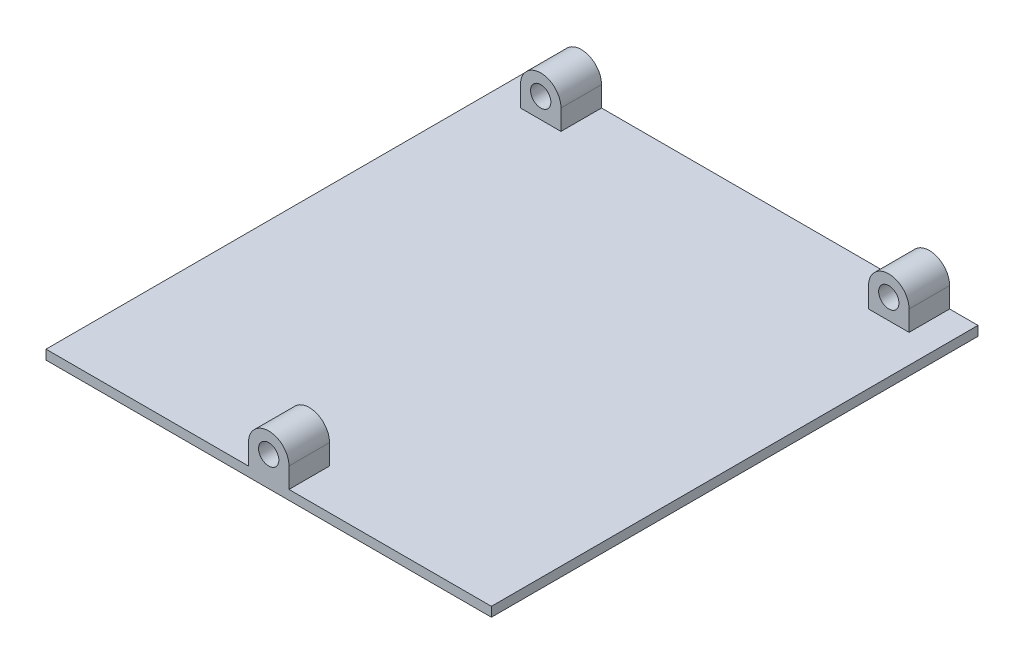
ISO-10303-21;
HEADER;
FILE_DESCRIPTION(('STEP AP214'),'2;1');
FILE_NAME('part.step','',(''),(''),'','','');
FILE_SCHEMA(('AUTOMOTIVE_DESIGN { 1 0 10303 214 1 1 1 1 }'));
ENDSEC;
DATA;
#1=APPLICATION_CONTEXT('core data for automotive mechanical design processes');
#2=APPLICATION_PROTOCOL_DEFINITION('international standard','automotive_design',2000,#1);
#3=PRODUCT_CONTEXT('',#1,'mechanical');
#4=PRODUCT('Part','Part','',(#3));
#5=PRODUCT_RELATED_PRODUCT_CATEGORY('part','',(#4));
#6=PRODUCT_DEFINITION_FORMATION('','',#4);
#7=PRODUCT_DEFINITION_CONTEXT('part definition',#1,'design');
#8=PRODUCT_DEFINITION('design','',#6,#7);
#9=PRODUCT_DEFINITION_SHAPE('','',#8);
#10=(LENGTH_UNIT() NAMED_UNIT(*) SI_UNIT(.MILLI.,.METRE.));
#11=(NAMED_UNIT(*) PLANE_ANGLE_UNIT() SI_UNIT($,.RADIAN.));
#12=(NAMED_UNIT(*) SI_UNIT($,.STERADIAN.) SOLID_ANGLE_UNIT());
#13=UNCERTAINTY_MEASURE_WITH_UNIT(LENGTH_MEASURE(1.E-05),#10,'distance_accuracy_value','');
#14=(GEOMETRIC_REPRESENTATION_CONTEXT(3) GLOBAL_UNCERTAINTY_ASSIGNED_CONTEXT((#13)) GLOBAL_UNIT_ASSIGNED_CONTEXT((#10,
#11,#12)) REPRESENTATION_CONTEXT('',''));
#15=CARTESIAN_POINT('',(0.,0.,0.));
#16=DIRECTION('',(0.,0.,1.));
#17=DIRECTION('',(1.,0.,0.));
#18=AXIS2_PLACEMENT_3D('',#15,#16,#17);
#19=CARTESIAN_POINT('',(0.,6.35,0.));
#20=DIRECTION('',(1.,0.,0.));
#21=DIRECTION('',(0.,0.,-1.));
#22=AXIS2_PLACEMENT_3D('',#19,#20,#21);
#23=PLANE('',#22);
#24=DIRECTION('',(0.,0.,1.));
#25=VECTOR('',#24,1.);
#26=CARTESIAN_POINT('',(0.,2.975,-152.4));
#27=LINE('',#26,#25);
#28=CARTESIAN_POINT('',(0.,2.975,-152.4));
#29=VERTEX_POINT('',#28);
#30=CARTESIAN_POINT('',(0.,2.975,0.));
#31=VERTEX_POINT('',#30);
#32=EDGE_CURVE('E252',#29,#31,#27,.T.);
#33=ORIENTED_EDGE('',*,*,#32,.F.);
#34=DIRECTION('',(0.,-1.,0.));
#35=VECTOR('',#34,1.);
#36=CARTESIAN_POINT('',(0.,6.35,-152.4));
#37=LINE('',#36,#35);
#38=CARTESIAN_POINT('',(0.,0.,-152.4));
#39=VERTEX_POINT('',#38);
#40=EDGE_CURVE('E282',#29,#39,#37,.T.);
#41=ORIENTED_EDGE('',*,*,#40,.T.);
#42=DIRECTION('',(0.,0.,1.));
#43=VECTOR('',#42,1.);
#44=CARTESIAN_POINT('',(0.,0.,0.));
#45=LINE('',#44,#43);
#46=CARTESIAN_POINT('',(0.,0.,0.));
#47=VERTEX_POINT('',#46);
#48=EDGE_CURVE('E269',#39,#47,#45,.T.);
#49=ORIENTED_EDGE('',*,*,#48,.T.);
#50=DIRECTION('',(0.,-1.,0.));
#51=VECTOR('',#50,1.);
#52=CARTESIAN_POINT('',(0.,6.35,0.));
#53=LINE('',#52,#51);
#54=EDGE_CURVE('E11',#31,#47,#53,.T.);
#55=ORIENTED_EDGE('',*,*,#54,.F.);
#56=EDGE_LOOP('',(#33,#41,#49,#55));
#57=FACE_BOUND('',#56,.T.);
#58=ADVANCED_FACE('F37',(#57),#23,.F.);
#59=CARTESIAN_POINT('',(0.,6.35,0.));
#60=DIRECTION('',(0.,0.,-1.));
#61=DIRECTION('',(-1.,0.,0.));
#62=AXIS2_PLACEMENT_3D('',#59,#60,#61);
#63=PLANE('',#62);
#64=DIRECTION('',(1.,0.,0.));
#65=VECTOR('',#64,1.);
#66=CARTESIAN_POINT('',(0.,2.975,0.));
#67=LINE('',#66,#65);
#68=CARTESIAN_POINT('',(63.4,2.975,0.));
#69=VERTEX_POINT('',#68);
#70=EDGE_CURVE('E261',#31,#69,#67,.T.);
#71=ORIENTED_EDGE('',*,*,#70,.F.);
#72=ORIENTED_EDGE('',*,*,#54,.T.);
#73=DIRECTION('',(1.,0.,0.));
#74=VECTOR('',#73,1.);
#75=CARTESIAN_POINT('',(0.,0.,0.));
#76=LINE('',#75,#74);
#77=CARTESIAN_POINT('',(139.5,0.,0.));
#78=VERTEX_POINT('',#77);
#79=EDGE_CURVE('E273',#47,#78,#76,.T.);
#80=ORIENTED_EDGE('',*,*,#79,.T.);
#81=DIRECTION('',(0.,-1.,0.));
#82=VECTOR('',#81,1.);
#83=CARTESIAN_POINT('',(139.5,6.35,0.));
#84=LINE('',#83,#82);
#85=CARTESIAN_POINT('',(139.5,2.975,0.));
#86=VERTEX_POINT('',#85);
#87=EDGE_CURVE('E44',#86,#78,#84,.T.);
#88=ORIENTED_EDGE('',*,*,#87,.F.);
#89=CARTESIAN_POINT('',(76.1,2.975,0.));
#90=VERTEX_POINT('',#89);
#91=EDGE_CURVE('E260',#90,#86,#67,.T.);
#92=ORIENTED_EDGE('',*,*,#91,.F.);
#93=DIRECTION('',(0.,1.,0.));
#94=VECTOR('',#93,1.);
#95=CARTESIAN_POINT('',(76.1,9.32500063341215,0.));
#96=LINE('',#95,#94);
#97=CARTESIAN_POINT('',(76.1,9.32500063341215,0.));
#98=VERTEX_POINT('',#97);
#99=EDGE_CURVE('E233',#90,#98,#96,.T.);
#100=ORIENTED_EDGE('',*,*,#99,.T.);
#101=CARTESIAN_POINT('',(69.75,9.32500031670607,0.));
#102=DIRECTION('',(0.,0.,1.));
#103=DIRECTION('',(1.,0.,0.));
#104=AXIS2_PLACEMENT_3D('',#101,#102,#103);
#105=CIRCLE('',#104,6.35);
#106=CARTESIAN_POINT('',(63.4,9.325,0.));
#107=VERTEX_POINT('',#106);
#108=EDGE_CURVE('E226',#98,#107,#105,.T.);
#109=ORIENTED_EDGE('',*,*,#108,.T.);
#110=DIRECTION('',(0.,-1.,0.));
#111=VECTOR('',#110,1.);
#112=CARTESIAN_POINT('',(63.4,9.325,0.));
#113=LINE('',#112,#111);
#114=EDGE_CURVE('E245',#107,#69,#113,.T.);
#115=ORIENTED_EDGE('',*,*,#114,.T.);
#116=EDGE_LOOP('',(#71,#72,#80,#88,#92,#100,#109,#115));
#117=FACE_BOUND('',#116,.T.);
#118=CARTESIAN_POINT('',(69.75,9.32500031670607,0.));
#119=DIRECTION('',(0.,0.,1.));
#120=DIRECTION('',(1.,0.,0.));
#121=AXIS2_PLACEMENT_3D('',#118,#119,#120);
#122=CIRCLE('',#121,3.17499999999998);
#123=CARTESIAN_POINT('',(72.925,9.32500031670607,0.));
#124=VERTEX_POINT('',#123);
#125=EDGE_CURVE('E215',#124,#124,#122,.T.);
#126=ORIENTED_EDGE('',*,*,#125,.F.);
#127=EDGE_LOOP('',(#126));
#128=FACE_BOUND('',#127,.T.);
#129=ADVANCED_FACE('F296',(#117,#128),#63,.F.);
#130=CARTESIAN_POINT('',(139.5,6.35,0.));
#131=DIRECTION('',(-1.,0.,0.));
#132=DIRECTION('',(0.,0.,1.));
#133=AXIS2_PLACEMENT_3D('',#130,#131,#132);
#134=PLANE('',#133);
#135=DIRECTION('',(0.,0.,-1.));
#136=VECTOR('',#135,1.);
#137=CARTESIAN_POINT('',(139.5,2.975,-152.4));
#138=LINE('',#137,#136);
#139=CARTESIAN_POINT('',(139.5,2.975,-152.4));
#140=VERTEX_POINT('',#139);
#141=EDGE_CURVE('E264',#86,#140,#138,.T.);
#142=ORIENTED_EDGE('',*,*,#141,.F.);
#143=ORIENTED_EDGE('',*,*,#87,.T.);
#144=DIRECTION('',(0.,0.,-1.));
#145=VECTOR('',#144,1.);
#146=CARTESIAN_POINT('',(139.5,0.,0.));
#147=LINE('',#146,#145);
#148=CARTESIAN_POINT('',(139.5,0.,-152.4));
#149=VERTEX_POINT('',#148);
#150=EDGE_CURVE('E276',#78,#149,#147,.T.);
#151=ORIENTED_EDGE('',*,*,#150,.T.);
#152=DIRECTION('',(0.,-1.,0.));
#153=VECTOR('',#152,1.);
#154=CARTESIAN_POINT('',(139.5,6.35,-152.4));
#155=LINE('',#154,#153);
#156=EDGE_CURVE('E284',#140,#149,#155,.T.);
#157=ORIENTED_EDGE('',*,*,#156,.F.);
#158=EDGE_LOOP('',(#142,#143,#151,#157));
#159=FACE_BOUND('',#158,.T.);
#160=ADVANCED_FACE('F288',(#159),#134,.F.);
#161=CARTESIAN_POINT('',(0.,6.35,-152.4));
#162=DIRECTION('',(0.,0.,1.));
#163=DIRECTION('',(1.,0.,0.));
#164=AXIS2_PLACEMENT_3D('',#161,#162,#163);
#165=PLANE('',#164);
#166=DIRECTION('',(-1.,0.,0.));
#167=VECTOR('',#166,1.);
#168=CARTESIAN_POINT('',(0.,2.975,-152.4));
#169=LINE('',#168,#167);
#170=CARTESIAN_POINT('',(130.61,2.975,-152.4));
#171=VERTEX_POINT('',#170);
#172=EDGE_CURVE('E267',#140,#171,#169,.T.);
#173=ORIENTED_EDGE('',*,*,#172,.F.);
#174=ORIENTED_EDGE('',*,*,#156,.T.);
#175=DIRECTION('',(-1.,0.,0.));
#176=VECTOR('',#175,1.);
#177=CARTESIAN_POINT('',(0.,0.,-152.4));
#178=LINE('',#177,#176);
#179=EDGE_CURVE('E279',#149,#39,#178,.T.);
#180=ORIENTED_EDGE('',*,*,#179,.T.);
#181=ORIENTED_EDGE('',*,*,#40,.F.);
#182=CARTESIAN_POINT('',(8.89,2.975,-152.4));
#183=VERTEX_POINT('',#182);
#184=EDGE_CURVE('E266',#183,#29,#169,.T.);
#185=ORIENTED_EDGE('',*,*,#184,.F.);
#186=DIRECTION('',(0.,1.,0.));
#187=VECTOR('',#186,1.);
#188=CARTESIAN_POINT('',(8.89,9.325,-152.4));
#189=LINE('',#188,#187);
#190=CARTESIAN_POINT('',(8.89,9.325,-152.4));
#191=VERTEX_POINT('',#190);
#192=EDGE_CURVE('E168',#183,#191,#189,.T.);
#193=ORIENTED_EDGE('',*,*,#192,.T.);
#194=CARTESIAN_POINT('',(15.24,9.325,-152.4));
#195=DIRECTION('',(0.,0.,-1.));
#196=DIRECTION('',(-1.,0.,0.));
#197=AXIS2_PLACEMENT_3D('',#194,#195,#196);
#198=CIRCLE('',#197,6.35);
#199=CARTESIAN_POINT('',(21.59,9.325,-152.4));
#200=VERTEX_POINT('',#199);
#201=EDGE_CURVE('E178',#191,#200,#198,.T.);
#202=ORIENTED_EDGE('',*,*,#201,.T.);
#203=DIRECTION('',(0.,-1.,0.));
#204=VECTOR('',#203,1.);
#205=CARTESIAN_POINT('',(21.59,9.325,-152.4));
#206=LINE('',#205,#204);
#207=CARTESIAN_POINT('',(21.59,2.975,-152.4));
#208=VERTEX_POINT('',#207);
#209=EDGE_CURVE('E152',#200,#208,#206,.T.);
#210=ORIENTED_EDGE('',*,*,#209,.T.);
#211=CARTESIAN_POINT('',(117.91,2.975,-152.4));
#212=VERTEX_POINT('',#211);
#213=EDGE_CURVE('E270',#212,#208,#169,.T.);
#214=ORIENTED_EDGE('',*,*,#213,.F.);
#215=DIRECTION('',(0.,1.,0.));
#216=VECTOR('',#215,1.);
#217=CARTESIAN_POINT('',(117.91,9.325,-152.4));
#218=LINE('',#217,#216);
#219=CARTESIAN_POINT('',(117.91,9.325,-152.4));
#220=VERTEX_POINT('',#219);
#221=EDGE_CURVE('E197',#212,#220,#218,.T.);
#222=ORIENTED_EDGE('',*,*,#221,.T.);
#223=CARTESIAN_POINT('',(124.26,9.325,-152.4));
#224=DIRECTION('',(0.,0.,-1.));
#225=DIRECTION('',(-1.,0.,0.));
#226=AXIS2_PLACEMENT_3D('',#223,#224,#225);
#227=CIRCLE('',#226,6.35);
#228=CARTESIAN_POINT('',(130.61,9.325,-152.4));
#229=VERTEX_POINT('',#228);
#230=EDGE_CURVE('E190',#220,#229,#227,.T.);
#231=ORIENTED_EDGE('',*,*,#230,.T.);
#232=DIRECTION('',(0.,-1.,0.));
#233=VECTOR('',#232,1.);
#234=CARTESIAN_POINT('',(130.61,9.325,-152.4));
#235=LINE('',#234,#233);
#236=EDGE_CURVE('E208',#229,#171,#235,.T.);
#237=ORIENTED_EDGE('',*,*,#236,.T.);
#238=EDGE_LOOP('',(#173,#174,#180,#181,#185,#193,#202,#210,#214,#222,#231,#237));
#239=FACE_BOUND('',#238,.T.);
#240=CARTESIAN_POINT('',(124.26,9.325,-152.4));
#241=DIRECTION('',(0.,0.,-1.));
#242=DIRECTION('',(-1.,0.,0.));
#243=AXIS2_PLACEMENT_3D('',#240,#241,#242);
#244=CIRCLE('',#243,3.17500000072341);
#245=CARTESIAN_POINT('',(121.084999999277,9.325,-152.4));
#246=VERTEX_POINT('',#245);
#247=EDGE_CURVE('E183',#246,#246,#244,.T.);
#248=ORIENTED_EDGE('',*,*,#247,.F.);
#249=EDGE_LOOP('',(#248));
#250=FACE_BOUND('',#249,.T.);
#251=CARTESIAN_POINT('',(15.24,9.325,-152.4));
#252=DIRECTION('',(0.,0.,-1.));
#253=DIRECTION('',(-1.,0.,0.));
#254=AXIS2_PLACEMENT_3D('',#251,#252,#253);
#255=CIRCLE('',#254,3.17500000036169);
#256=CARTESIAN_POINT('',(12.0649999996383,9.325,-152.4));
#257=VERTEX_POINT('',#256);
#258=EDGE_CURVE('E173',#257,#257,#255,.T.);
#259=ORIENTED_EDGE('',*,*,#258,.F.);
#260=EDGE_LOOP('',(#259));
#261=FACE_BOUND('',#260,.T.);
#262=ADVANCED_FACE('F305',(#239,#250,#261),#165,.F.);
#263=CARTESIAN_POINT('',(0.,0.,0.));
#264=DIRECTION('',(0.,-1.,0.));
#265=DIRECTION('',(0.,0.,-1.));
#266=AXIS2_PLACEMENT_3D('',#263,#264,#265);
#267=PLANE('',#266);
#268=ORIENTED_EDGE('',*,*,#48,.F.);
#269=ORIENTED_EDGE('',*,*,#179,.F.);
#270=ORIENTED_EDGE('',*,*,#150,.F.);
#271=ORIENTED_EDGE('',*,*,#79,.F.);
#272=EDGE_LOOP('',(#268,#269,#270,#271));
#273=FACE_BOUND('',#272,.T.);
#274=ADVANCED_FACE('F301',(#273),#267,.T.);
#275=CARTESIAN_POINT('',(0.,2.975,0.));
#276=DIRECTION('',(0.,1.,0.));
#277=DIRECTION('',(0.,0.,1.));
#278=AXIS2_PLACEMENT_3D('',#275,#276,#277);
#279=PLANE('',#278);
#280=DIRECTION('',(0.,0.,-1.));
#281=VECTOR('',#280,1.);
#282=CARTESIAN_POINT('',(8.89,2.975,-139.7));
#283=LINE('',#282,#281);
#284=CARTESIAN_POINT('',(8.89,2.975,-139.7));
#285=VERTEX_POINT('',#284);
#286=EDGE_CURVE('E184',#285,#183,#283,.T.);
#287=ORIENTED_EDGE('',*,*,#286,.T.);
#288=ORIENTED_EDGE('',*,*,#184,.T.);
#289=ORIENTED_EDGE('',*,*,#32,.T.);
#290=ORIENTED_EDGE('',*,*,#70,.T.);
#291=DIRECTION('',(0.,0.,1.));
#292=VECTOR('',#291,1.);
#293=CARTESIAN_POINT('',(63.4,2.975,-12.7));
#294=LINE('',#293,#292);
#295=CARTESIAN_POINT('',(63.4,2.975,-12.7));
#296=VERTEX_POINT('',#295);
#297=EDGE_CURVE('E256',#296,#69,#294,.T.);
#298=ORIENTED_EDGE('',*,*,#297,.F.);
#299=DIRECTION('',(1.,0.,0.));
#300=VECTOR('',#299,1.);
#301=CARTESIAN_POINT('',(63.4,2.975,-12.7));
#302=LINE('',#301,#300);
#303=CARTESIAN_POINT('',(76.1,2.97500000000001,-12.7));
#304=VERTEX_POINT('',#303);
#305=EDGE_CURVE('E236',#296,#304,#302,.T.);
#306=ORIENTED_EDGE('',*,*,#305,.T.);
#307=DIRECTION('',(0.,0.,1.));
#308=VECTOR('',#307,1.);
#309=CARTESIAN_POINT('',(76.1,2.97500000000001,-12.7));
#310=LINE('',#309,#308);
#311=EDGE_CURVE('E253',#304,#90,#310,.T.);
#312=ORIENTED_EDGE('',*,*,#311,.T.);
#313=ORIENTED_EDGE('',*,*,#91,.T.);
#314=ORIENTED_EDGE('',*,*,#141,.T.);
#315=ORIENTED_EDGE('',*,*,#172,.T.);
#316=DIRECTION('',(0.,0.,-1.));
#317=VECTOR('',#316,1.);
#318=CARTESIAN_POINT('',(130.61,2.975,-139.7));
#319=LINE('',#318,#317);
#320=CARTESIAN_POINT('',(130.61,2.975,-139.7));
#321=VERTEX_POINT('',#320);
#322=EDGE_CURVE('E219',#321,#171,#319,.T.);
#323=ORIENTED_EDGE('',*,*,#322,.F.);
#324=DIRECTION('',(-1.,0.,0.));
#325=VECTOR('',#324,1.);
#326=CARTESIAN_POINT('',(130.61,2.975,-139.7));
#327=LINE('',#326,#325);
#328=CARTESIAN_POINT('',(117.91,2.975,-139.7));
#329=VERTEX_POINT('',#328);
#330=EDGE_CURVE('E200',#321,#329,#327,.T.);
#331=ORIENTED_EDGE('',*,*,#330,.T.);
#332=DIRECTION('',(0.,0.,-1.));
#333=VECTOR('',#332,1.);
#334=CARTESIAN_POINT('',(117.91,2.975,-139.7));
#335=LINE('',#334,#333);
#336=EDGE_CURVE('E216',#329,#212,#335,.T.);
#337=ORIENTED_EDGE('',*,*,#336,.T.);
#338=ORIENTED_EDGE('',*,*,#213,.T.);
#339=DIRECTION('',(0.,0.,-1.));
#340=VECTOR('',#339,1.);
#341=CARTESIAN_POINT('',(21.59,2.975,-139.7));
#342=LINE('',#341,#340);
#343=CARTESIAN_POINT('',(21.59,2.975,-139.7));
#344=VERTEX_POINT('',#343);
#345=EDGE_CURVE('E56',#344,#208,#342,.T.);
#346=ORIENTED_EDGE('',*,*,#345,.F.);
#347=DIRECTION('',(-1.,0.,0.));
#348=VECTOR('',#347,1.);
#349=CARTESIAN_POINT('',(21.59,2.975,-139.7));
#350=LINE('',#349,#348);
#351=EDGE_CURVE('E51',#344,#285,#350,.T.);
#352=ORIENTED_EDGE('',*,*,#351,.T.);
#353=EDGE_LOOP('',(#287,#288,#289,#290,#298,#306,#312,#313,#314,#315,#323,#331,#337,#338,#346,#352));
#354=FACE_BOUND('',#353,.T.);
#355=ADVANCED_FACE('F308',(#354),#279,.T.);
#356=CARTESIAN_POINT('',(69.75,9.32500031670607,-12.7));
#357=DIRECTION('',(0.,0.,1.));
#358=DIRECTION('',(1.,0.,0.));
#359=AXIS2_PLACEMENT_3D('',#356,#357,#358);
#360=CYLINDRICAL_SURFACE('',#359,6.35);
#361=ORIENTED_EDGE('',*,*,#108,.F.);
#362=DIRECTION('',(0.,0.,1.));
#363=VECTOR('',#362,1.);
#364=CARTESIAN_POINT('',(76.1,9.32500063341215,-12.7));
#365=LINE('',#364,#363);
#366=CARTESIAN_POINT('',(76.1,9.32500063341215,-12.7));
#367=VERTEX_POINT('',#366);
#368=EDGE_CURVE('E250',#367,#98,#365,.T.);
#369=ORIENTED_EDGE('',*,*,#368,.F.);
#370=CARTESIAN_POINT('',(69.75,9.32500031670607,-12.7));
#371=DIRECTION('',(0.,0.,1.));
#372=DIRECTION('',(1.,0.,0.));
#373=AXIS2_PLACEMENT_3D('',#370,#371,#372);
#374=CIRCLE('',#373,6.35);
#375=CARTESIAN_POINT('',(63.4,9.325,-12.7));
#376=VERTEX_POINT('',#375);
#377=EDGE_CURVE('E229',#367,#376,#374,.T.);
#378=ORIENTED_EDGE('',*,*,#377,.T.);
#379=DIRECTION('',(0.,0.,1.));
#380=VECTOR('',#379,1.);
#381=CARTESIAN_POINT('',(63.4,9.325,-12.7));
#382=LINE('',#381,#380);
#383=EDGE_CURVE('E242',#376,#107,#382,.T.);
#384=ORIENTED_EDGE('',*,*,#383,.T.);
#385=EDGE_LOOP('',(#361,#369,#378,#384));
#386=FACE_BOUND('',#385,.T.);
#387=ADVANCED_FACE('F344',(#386),#360,.T.);
#388=CARTESIAN_POINT('',(76.1,9.32500063341215,-12.7));
#389=DIRECTION('',(1.,0.,0.));
#390=DIRECTION('',(0.,0.,-1.));
#391=AXIS2_PLACEMENT_3D('',#388,#389,#390);
#392=PLANE('',#391);
#393=ORIENTED_EDGE('',*,*,#99,.F.);
#394=ORIENTED_EDGE('',*,*,#311,.F.);
#395=DIRECTION('',(0.,1.,0.));
#396=VECTOR('',#395,1.);
#397=CARTESIAN_POINT('',(76.1,9.32500063341215,-12.7));
#398=LINE('',#397,#396);
#399=EDGE_CURVE('E239',#304,#367,#398,.T.);
#400=ORIENTED_EDGE('',*,*,#399,.T.);
#401=ORIENTED_EDGE('',*,*,#368,.T.);
#402=EDGE_LOOP('',(#393,#394,#400,#401));
#403=FACE_BOUND('',#402,.T.);
#404=ADVANCED_FACE('F347',(#403),#392,.T.);
#405=CARTESIAN_POINT('',(63.4,9.325,-12.7));
#406=DIRECTION('',(-1.,0.,0.));
#407=DIRECTION('',(0.,0.,1.));
#408=AXIS2_PLACEMENT_3D('',#405,#406,#407);
#409=PLANE('',#408);
#410=ORIENTED_EDGE('',*,*,#114,.F.);
#411=ORIENTED_EDGE('',*,*,#383,.F.);
#412=DIRECTION('',(0.,-1.,0.));
#413=VECTOR('',#412,1.);
#414=CARTESIAN_POINT('',(63.4,9.325,-12.7));
#415=LINE('',#414,#413);
#416=EDGE_CURVE('E232',#376,#296,#415,.T.);
#417=ORIENTED_EDGE('',*,*,#416,.T.);
#418=ORIENTED_EDGE('',*,*,#297,.T.);
#419=EDGE_LOOP('',(#410,#411,#417,#418));
#420=FACE_BOUND('',#419,.T.);
#421=ADVANCED_FACE('F349',(#420),#409,.T.);
#422=CARTESIAN_POINT('',(69.75,9.32500031670607,-12.7));
#423=DIRECTION('',(0.,0.,1.));
#424=DIRECTION('',(1.,0.,0.));
#425=AXIS2_PLACEMENT_3D('',#422,#423,#424);
#426=PLANE('',#425);
#427=CARTESIAN_POINT('',(69.75,9.32500031670607,-12.7));
#428=DIRECTION('',(0.,0.,1.));
#429=DIRECTION('',(1.,0.,0.));
#430=AXIS2_PLACEMENT_3D('',#427,#428,#429);
#431=CIRCLE('',#430,3.17499999999998);
#432=CARTESIAN_POINT('',(72.925,9.32500031670607,-12.7));
#433=VERTEX_POINT('',#432);
#434=EDGE_CURVE('E223',#433,#433,#431,.T.);
#435=ORIENTED_EDGE('',*,*,#434,.T.);
#436=EDGE_LOOP('',(#435));
#437=FACE_BOUND('',#436,.T.);
#438=ORIENTED_EDGE('',*,*,#377,.F.);
#439=ORIENTED_EDGE('',*,*,#399,.F.);
#440=ORIENTED_EDGE('',*,*,#305,.F.);
#441=ORIENTED_EDGE('',*,*,#416,.F.);
#442=EDGE_LOOP('',(#438,#439,#440,#441));
#443=FACE_BOUND('',#442,.T.);
#444=ADVANCED_FACE('F352',(#437,#443),#426,.F.);
#445=CARTESIAN_POINT('',(69.75,9.32500031670607,-12.7));
#446=DIRECTION('',(0.,0.,1.));
#447=DIRECTION('',(1.,0.,0.));
#448=AXIS2_PLACEMENT_3D('',#445,#446,#447);
#449=CYLINDRICAL_SURFACE('',#448,3.17499999999998);
#450=ORIENTED_EDGE('',*,*,#434,.F.);
#451=EDGE_LOOP('',(#450));
#452=FACE_BOUND('',#451,.T.);
#453=ORIENTED_EDGE('',*,*,#125,.T.);
#454=EDGE_LOOP('',(#453));
#455=FACE_BOUND('',#454,.T.);
#456=ADVANCED_FACE('F359',(#452,#455),#449,.F.);
#457=CARTESIAN_POINT('',(124.26,9.325,-139.7));
#458=DIRECTION('',(0.,0.,-1.));
#459=DIRECTION('',(-1.,0.,0.));
#460=AXIS2_PLACEMENT_3D('',#457,#458,#459);
#461=CYLINDRICAL_SURFACE('',#460,6.35);
#462=ORIENTED_EDGE('',*,*,#230,.F.);
#463=DIRECTION('',(0.,0.,-1.));
#464=VECTOR('',#463,1.);
#465=CARTESIAN_POINT('',(117.91,9.325,-139.7));
#466=LINE('',#465,#464);
#467=CARTESIAN_POINT('',(117.91,9.325,-139.7));
#468=VERTEX_POINT('',#467);
#469=EDGE_CURVE('E213',#468,#220,#466,.T.);
#470=ORIENTED_EDGE('',*,*,#469,.F.);
#471=CARTESIAN_POINT('',(124.26,9.325,-139.7));
#472=DIRECTION('',(0.,0.,-1.));
#473=DIRECTION('',(-1.,0.,0.));
#474=AXIS2_PLACEMENT_3D('',#471,#472,#473);
#475=CIRCLE('',#474,6.35);
#476=CARTESIAN_POINT('',(130.61,9.325,-139.7));
#477=VERTEX_POINT('',#476);
#478=EDGE_CURVE('E193',#468,#477,#475,.T.);
#479=ORIENTED_EDGE('',*,*,#478,.T.);
#480=DIRECTION('',(0.,0.,-1.));
#481=VECTOR('',#480,1.);
#482=CARTESIAN_POINT('',(130.61,9.325,-139.7));
#483=LINE('',#482,#481);
#484=EDGE_CURVE('E205',#477,#229,#483,.T.);
#485=ORIENTED_EDGE('',*,*,#484,.T.);
#486=EDGE_LOOP('',(#462,#470,#479,#485));
#487=FACE_BOUND('',#486,.T.);
#488=ADVANCED_FACE('F319',(#487),#461,.T.);
#489=CARTESIAN_POINT('',(117.91,9.325,-139.7));
#490=DIRECTION('',(-1.,0.,0.));
#491=DIRECTION('',(0.,0.,1.));
#492=AXIS2_PLACEMENT_3D('',#489,#490,#491);
#493=PLANE('',#492);
#494=ORIENTED_EDGE('',*,*,#221,.F.);
#495=ORIENTED_EDGE('',*,*,#336,.F.);
#496=DIRECTION('',(0.,1.,0.));
#497=VECTOR('',#496,1.);
#498=CARTESIAN_POINT('',(117.91,9.325,-139.7));
#499=LINE('',#498,#497);
#500=EDGE_CURVE('E202',#329,#468,#499,.T.);
#501=ORIENTED_EDGE('',*,*,#500,.T.);
#502=ORIENTED_EDGE('',*,*,#469,.T.);
#503=EDGE_LOOP('',(#494,#495,#501,#502));
#504=FACE_BOUND('',#503,.T.);
#505=ADVANCED_FACE('F322',(#504),#493,.T.);
#506=CARTESIAN_POINT('',(130.61,9.325,-139.7));
#507=DIRECTION('',(1.,0.,0.));
#508=DIRECTION('',(0.,0.,-1.));
#509=AXIS2_PLACEMENT_3D('',#506,#507,#508);
#510=PLANE('',#509);
#511=ORIENTED_EDGE('',*,*,#236,.F.);
#512=ORIENTED_EDGE('',*,*,#484,.F.);
#513=DIRECTION('',(0.,-1.,0.));
#514=VECTOR('',#513,1.);
#515=CARTESIAN_POINT('',(130.61,9.325,-139.7));
#516=LINE('',#515,#514);
#517=EDGE_CURVE('E196',#477,#321,#516,.T.);
#518=ORIENTED_EDGE('',*,*,#517,.T.);
#519=ORIENTED_EDGE('',*,*,#322,.T.);
#520=EDGE_LOOP('',(#511,#512,#518,#519));
#521=FACE_BOUND('',#520,.T.);
#522=ADVANCED_FACE('F311',(#521),#510,.T.);
#523=CARTESIAN_POINT('',(124.26,9.325,-139.7));
#524=DIRECTION('',(0.,0.,-1.));
#525=DIRECTION('',(-1.,0.,0.));
#526=AXIS2_PLACEMENT_3D('',#523,#524,#525);
#527=PLANE('',#526);
#528=CARTESIAN_POINT('',(124.26,9.325,-139.7));
#529=DIRECTION('',(0.,0.,-1.));
#530=DIRECTION('',(-1.,0.,0.));
#531=AXIS2_PLACEMENT_3D('',#528,#529,#530);
#532=CIRCLE('',#531,3.17500000072341);
#533=CARTESIAN_POINT('',(121.084999999277,9.325,-139.7));
#534=VERTEX_POINT('',#533);
#535=EDGE_CURVE('E187',#534,#534,#532,.T.);
#536=ORIENTED_EDGE('',*,*,#535,.T.);
#537=EDGE_LOOP('',(#536));
#538=FACE_BOUND('',#537,.T.);
#539=ORIENTED_EDGE('',*,*,#478,.F.);
#540=ORIENTED_EDGE('',*,*,#500,.F.);
#541=ORIENTED_EDGE('',*,*,#330,.F.);
#542=ORIENTED_EDGE('',*,*,#517,.F.);
#543=EDGE_LOOP('',(#539,#540,#541,#542));
#544=FACE_BOUND('',#543,.T.);
#545=ADVANCED_FACE('F315',(#538,#544),#527,.F.);
#546=CARTESIAN_POINT('',(124.26,9.325,-139.7));
#547=DIRECTION('',(0.,0.,-1.));
#548=DIRECTION('',(-1.,0.,0.));
#549=AXIS2_PLACEMENT_3D('',#546,#547,#548);
#550=CYLINDRICAL_SURFACE('',#549,3.17500000072341);
#551=ORIENTED_EDGE('',*,*,#535,.F.);
#552=EDGE_LOOP('',(#551));
#553=FACE_BOUND('',#552,.T.);
#554=ORIENTED_EDGE('',*,*,#247,.T.);
#555=EDGE_LOOP('',(#554));
#556=FACE_BOUND('',#555,.T.);
#557=ADVANCED_FACE('F372',(#553,#556),#550,.F.);
#558=CARTESIAN_POINT('',(15.24,9.325,-139.7));
#559=DIRECTION('',(0.,0.,-1.));
#560=DIRECTION('',(-1.,0.,0.));
#561=AXIS2_PLACEMENT_3D('',#558,#559,#560);
#562=CYLINDRICAL_SURFACE('',#561,6.35);
#563=ORIENTED_EDGE('',*,*,#201,.F.);
#564=DIRECTION('',(0.,0.,-1.));
#565=VECTOR('',#564,1.);
#566=CARTESIAN_POINT('',(8.89,9.325,-139.7));
#567=LINE('',#566,#565);
#568=CARTESIAN_POINT('',(8.89,9.325,-139.7));
#569=VERTEX_POINT('',#568);
#570=EDGE_CURVE('E167',#569,#191,#567,.T.);
#571=ORIENTED_EDGE('',*,*,#570,.F.);
#572=CARTESIAN_POINT('',(15.24,9.325,-139.7));
#573=DIRECTION('',(0.,0.,-1.));
#574=DIRECTION('',(-1.,0.,0.));
#575=AXIS2_PLACEMENT_3D('',#572,#573,#574);
#576=CIRCLE('',#575,6.35);
#577=CARTESIAN_POINT('',(21.59,9.325,-139.7));
#578=VERTEX_POINT('',#577);
#579=EDGE_CURVE('E163',#569,#578,#576,.T.);
#580=ORIENTED_EDGE('',*,*,#579,.T.);
#581=DIRECTION('',(0.,0.,-1.));
#582=VECTOR('',#581,1.);
#583=CARTESIAN_POINT('',(21.59,9.325,-139.7));
#584=LINE('',#583,#582);
#585=EDGE_CURVE('E147',#578,#200,#584,.T.);
#586=ORIENTED_EDGE('',*,*,#585,.T.);
#587=EDGE_LOOP('',(#563,#571,#580,#586));
#588=FACE_BOUND('',#587,.T.);
#589=ADVANCED_FACE('F166',(#588),#562,.T.);
#590=CARTESIAN_POINT('',(8.89,9.325,-139.7));
#591=DIRECTION('',(-1.,0.,0.));
#592=DIRECTION('',(0.,-1.,0.));
#593=AXIS2_PLACEMENT_3D('',#590,#591,#592);
#594=PLANE('',#593);
#595=ORIENTED_EDGE('',*,*,#192,.F.);
#596=ORIENTED_EDGE('',*,*,#286,.F.);
#597=DIRECTION('',(0.,1.,0.));
#598=VECTOR('',#597,1.);
#599=CARTESIAN_POINT('',(8.89,9.325,-139.7));
#600=LINE('',#599,#598);
#601=EDGE_CURVE('E157',#285,#569,#600,.T.);
#602=ORIENTED_EDGE('',*,*,#601,.T.);
#603=ORIENTED_EDGE('',*,*,#570,.T.);
#604=EDGE_LOOP('',(#595,#596,#602,#603));
#605=FACE_BOUND('',#604,.T.);
#606=ADVANCED_FACE('F326',(#605),#594,.T.);
#607=CARTESIAN_POINT('',(21.59,9.325,-139.7));
#608=DIRECTION('',(1.,0.,0.));
#609=DIRECTION('',(0.,1.,0.));
#610=AXIS2_PLACEMENT_3D('',#607,#608,#609);
#611=PLANE('',#610);
#612=ORIENTED_EDGE('',*,*,#209,.F.);
#613=ORIENTED_EDGE('',*,*,#585,.F.);
#614=DIRECTION('',(0.,-1.,0.));
#615=VECTOR('',#614,1.);
#616=CARTESIAN_POINT('',(21.59,9.325,-139.7));
#617=LINE('',#616,#615);
#618=EDGE_CURVE('E150',#578,#344,#617,.T.);
#619=ORIENTED_EDGE('',*,*,#618,.T.);
#620=ORIENTED_EDGE('',*,*,#345,.T.);
#621=EDGE_LOOP('',(#612,#613,#619,#620));
#622=FACE_BOUND('',#621,.T.);
#623=ADVANCED_FACE('F149',(#622),#611,.T.);
#624=CARTESIAN_POINT('',(15.24,9.325,-139.7));
#625=DIRECTION('',(0.,0.,-1.));
#626=DIRECTION('',(-1.,0.,0.));
#627=AXIS2_PLACEMENT_3D('',#624,#625,#626);
#628=PLANE('',#627);
#629=CARTESIAN_POINT('',(15.24,9.325,-139.7));
#630=DIRECTION('',(0.,0.,-1.));
#631=DIRECTION('',(-1.,0.,0.));
#632=AXIS2_PLACEMENT_3D('',#629,#630,#631);
#633=CIRCLE('',#632,3.17500000036169);
#634=CARTESIAN_POINT('',(12.0649999996383,9.325,-139.7));
#635=VERTEX_POINT('',#634);
#636=EDGE_CURVE('E180',#635,#635,#633,.T.);
#637=ORIENTED_EDGE('',*,*,#636,.T.);
#638=EDGE_LOOP('',(#637));
#639=FACE_BOUND('',#638,.T.);
#640=ORIENTED_EDGE('',*,*,#579,.F.);
#641=ORIENTED_EDGE('',*,*,#601,.F.);
#642=ORIENTED_EDGE('',*,*,#351,.F.);
#643=ORIENTED_EDGE('',*,*,#618,.F.);
#644=EDGE_LOOP('',(#640,#641,#642,#643));
#645=FACE_BOUND('',#644,.T.);
#646=ADVANCED_FACE('F161',(#639,#645),#628,.F.);
#647=CARTESIAN_POINT('',(15.24,9.325,-139.7));
#648=DIRECTION('',(0.,0.,-1.));
#649=DIRECTION('',(-1.,0.,0.));
#650=AXIS2_PLACEMENT_3D('',#647,#648,#649);
#651=CYLINDRICAL_SURFACE('',#650,3.17500000036169);
#652=ORIENTED_EDGE('',*,*,#636,.F.);
#653=EDGE_LOOP('',(#652));
#654=FACE_BOUND('',#653,.T.);
#655=ORIENTED_EDGE('',*,*,#258,.T.);
#656=EDGE_LOOP('',(#655));
#657=FACE_BOUND('',#656,.T.);
#658=ADVANCED_FACE('F385',(#654,#657),#651,.F.);
#659=CLOSED_SHELL('',(#58,#129,#160,#262,#274,#355,#387,#404,#421,#444,#456,#488,#505,#522,#545,
#557,#589,#606,#623,#646,#658));
#660=MANIFOLD_SOLID_BREP('B2',#659);
#661=ADVANCED_BREP_SHAPE_REPRESENTATION('',(#18,#660),#14);
#662=SHAPE_DEFINITION_REPRESENTATION(#9,#661);
ENDSEC;
END-ISO-10303-21;
